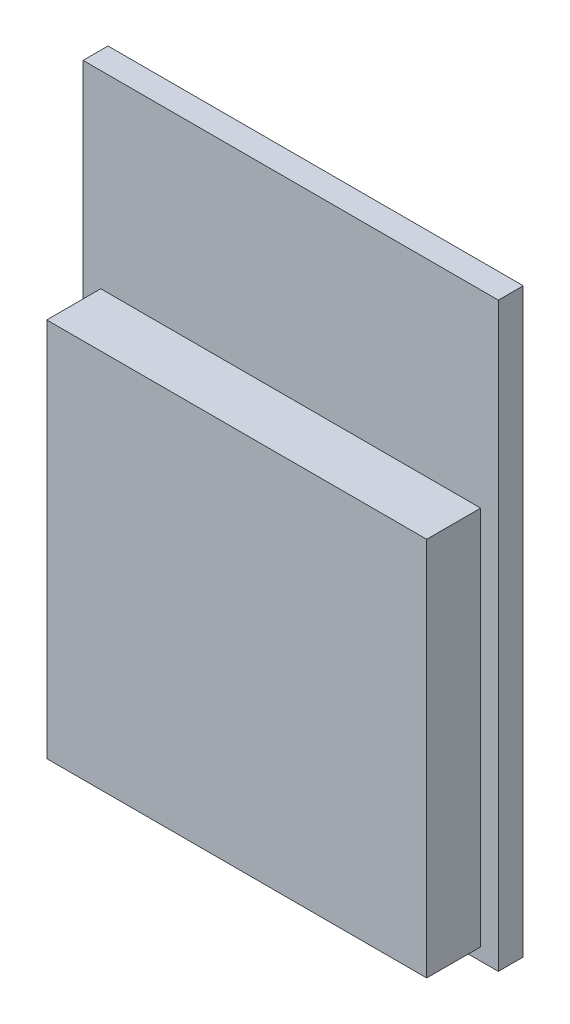
ISO-10303-21;
HEADER;
FILE_DESCRIPTION(('STEP AP214'),'2;1');
FILE_NAME('part.step','',(''),(''),'','','');
FILE_SCHEMA(('AUTOMOTIVE_DESIGN { 1 0 10303 214 1 1 1 1 }'));
ENDSEC;
DATA;
#1=APPLICATION_CONTEXT('core data for automotive mechanical design processes');
#2=APPLICATION_PROTOCOL_DEFINITION('international standard','automotive_design',2000,#1);
#3=PRODUCT_CONTEXT('',#1,'mechanical');
#4=PRODUCT('Part','Part','',(#3));
#5=PRODUCT_RELATED_PRODUCT_CATEGORY('part','',(#4));
#6=PRODUCT_DEFINITION_FORMATION('','',#4);
#7=PRODUCT_DEFINITION_CONTEXT('part definition',#1,'design');
#8=PRODUCT_DEFINITION('design','',#6,#7);
#9=PRODUCT_DEFINITION_SHAPE('','',#8);
#10=(LENGTH_UNIT() NAMED_UNIT(*) SI_UNIT(.MILLI.,.METRE.));
#11=(NAMED_UNIT(*) PLANE_ANGLE_UNIT() SI_UNIT($,.RADIAN.));
#12=(NAMED_UNIT(*) SI_UNIT($,.STERADIAN.) SOLID_ANGLE_UNIT());
#13=UNCERTAINTY_MEASURE_WITH_UNIT(LENGTH_MEASURE(1.E-05),#10,'distance_accuracy_value','');
#14=(GEOMETRIC_REPRESENTATION_CONTEXT(3) GLOBAL_UNCERTAINTY_ASSIGNED_CONTEXT((#13)) GLOBAL_UNIT_ASSIGNED_CONTEXT((#10,
#11,#12)) REPRESENTATION_CONTEXT('',''));
#15=CARTESIAN_POINT('',(0.,0.,0.));
#16=DIRECTION('',(0.,0.,1.));
#17=DIRECTION('',(1.,0.,0.));
#18=AXIS2_PLACEMENT_3D('',#15,#16,#17);
#19=CARTESIAN_POINT('',(0.,0.,0.6));
#20=DIRECTION('',(0.,0.,-1.));
#21=DIRECTION('',(-1.,0.,0.));
#22=AXIS2_PLACEMENT_3D('',#19,#20,#21);
#23=PLANE('',#22);
#24=DIRECTION('',(0.,1.,0.));
#25=VECTOR('',#24,1.);
#26=CARTESIAN_POINT('',(5.,-7.,0.6));
#27=LINE('',#26,#25);
#28=CARTESIAN_POINT('',(5.,-7.,0.6));
#29=VERTEX_POINT('',#28);
#30=CARTESIAN_POINT('',(5.,7.,0.6));
#31=VERTEX_POINT('',#30);
#32=EDGE_CURVE('E128',#29,#31,#27,.T.);
#33=ORIENTED_EDGE('',*,*,#32,.T.);
#34=DIRECTION('',(-1.,0.,0.));
#35=VECTOR('',#34,1.);
#36=CARTESIAN_POINT('',(-5.,7.,0.6));
#37=LINE('',#36,#35);
#38=CARTESIAN_POINT('',(-5.,7.,0.6));
#39=VERTEX_POINT('',#38);
#40=EDGE_CURVE('E131',#31,#39,#37,.T.);
#41=ORIENTED_EDGE('',*,*,#40,.T.);
#42=DIRECTION('',(0.,-1.,0.));
#43=VECTOR('',#42,1.);
#44=CARTESIAN_POINT('',(-5.,-7.,0.6));
#45=LINE('',#44,#43);
#46=CARTESIAN_POINT('',(-5.,-7.,0.6));
#47=VERTEX_POINT('',#46);
#48=EDGE_CURVE('E134',#39,#47,#45,.T.);
#49=ORIENTED_EDGE('',*,*,#48,.T.);
#50=DIRECTION('',(1.,0.,0.));
#51=VECTOR('',#50,1.);
#52=CARTESIAN_POINT('',(-5.,-7.,0.6));
#53=LINE('',#52,#51);
#54=EDGE_CURVE('E136',#47,#29,#53,.T.);
#55=ORIENTED_EDGE('',*,*,#54,.T.);
#56=EDGE_LOOP('',(#33,#41,#49,#55));
#57=FACE_BOUND('',#56,.T.);
#58=DIRECTION('',(0.,-1.,0.));
#59=VECTOR('',#58,1.);
#60=CARTESIAN_POINT('',(-4.575,2.45,0.6));
#61=LINE('',#60,#59);
#62=CARTESIAN_POINT('',(-4.575,2.45,0.6));
#63=VERTEX_POINT('',#62);
#64=CARTESIAN_POINT('',(-4.575,-6.7,0.6));
#65=VERTEX_POINT('',#64);
#66=EDGE_CURVE('E118',#63,#65,#61,.T.);
#67=ORIENTED_EDGE('',*,*,#66,.F.);
#68=DIRECTION('',(-1.,0.,0.));
#69=VECTOR('',#68,1.);
#70=CARTESIAN_POINT('',(-4.575,2.45,0.6));
#71=LINE('',#70,#69);
#72=CARTESIAN_POINT('',(4.575,2.45,0.6));
#73=VERTEX_POINT('',#72);
#74=EDGE_CURVE('E115',#73,#63,#71,.T.);
#75=ORIENTED_EDGE('',*,*,#74,.F.);
#76=DIRECTION('',(0.,1.,0.));
#77=VECTOR('',#76,1.);
#78=CARTESIAN_POINT('',(4.575,2.45,0.6));
#79=LINE('',#78,#77);
#80=CARTESIAN_POINT('',(4.57500000000001,-6.7,0.6));
#81=VERTEX_POINT('',#80);
#82=EDGE_CURVE('E53',#81,#73,#79,.T.);
#83=ORIENTED_EDGE('',*,*,#82,.F.);
#84=DIRECTION('',(1.,0.,0.));
#85=VECTOR('',#84,1.);
#86=CARTESIAN_POINT('',(-4.575,-6.7,0.6));
#87=LINE('',#86,#85);
#88=EDGE_CURVE('E48',#65,#81,#87,.T.);
#89=ORIENTED_EDGE('',*,*,#88,.F.);
#90=EDGE_LOOP('',(#67,#75,#83,#89));
#91=FACE_BOUND('',#90,.T.);
#92=ADVANCED_FACE('F33',(#57,#91),#23,.F.);
#93=CARTESIAN_POINT('',(5.,-7.,0.6));
#94=DIRECTION('',(-1.,0.,0.));
#95=DIRECTION('',(0.,0.,1.));
#96=AXIS2_PLACEMENT_3D('',#93,#94,#95);
#97=PLANE('',#96);
#98=DIRECTION('',(0.,1.,0.));
#99=VECTOR('',#98,1.);
#100=CARTESIAN_POINT('',(5.,-7.,0.));
#101=LINE('',#100,#99);
#102=CARTESIAN_POINT('',(5.,-7.,0.));
#103=VERTEX_POINT('',#102);
#104=CARTESIAN_POINT('',(5.,7.,0.));
#105=VERTEX_POINT('',#104);
#106=EDGE_CURVE('E119',#103,#105,#101,.T.);
#107=ORIENTED_EDGE('',*,*,#106,.T.);
#108=DIRECTION('',(0.,0.,-1.));
#109=VECTOR('',#108,1.);
#110=CARTESIAN_POINT('',(5.,7.,0.6));
#111=LINE('',#110,#109);
#112=EDGE_CURVE('E11',#31,#105,#111,.T.);
#113=ORIENTED_EDGE('',*,*,#112,.F.);
#114=ORIENTED_EDGE('',*,*,#32,.F.);
#115=DIRECTION('',(0.,0.,-1.));
#116=VECTOR('',#115,1.);
#117=CARTESIAN_POINT('',(5.,-7.,0.6));
#118=LINE('',#117,#116);
#119=EDGE_CURVE('E137',#29,#103,#118,.T.);
#120=ORIENTED_EDGE('',*,*,#119,.T.);
#121=EDGE_LOOP('',(#107,#113,#114,#120));
#122=FACE_BOUND('',#121,.T.);
#123=ADVANCED_FACE('F35',(#122),#97,.F.);
#124=CARTESIAN_POINT('',(-5.,7.,0.6));
#125=DIRECTION('',(0.,-1.,0.));
#126=DIRECTION('',(0.,0.,-1.));
#127=AXIS2_PLACEMENT_3D('',#124,#125,#126);
#128=PLANE('',#127);
#129=DIRECTION('',(-1.,0.,0.));
#130=VECTOR('',#129,1.);
#131=CARTESIAN_POINT('',(-5.,7.,0.));
#132=LINE('',#131,#130);
#133=CARTESIAN_POINT('',(-5.,7.,0.));
#134=VERTEX_POINT('',#133);
#135=EDGE_CURVE('E122',#105,#134,#132,.T.);
#136=ORIENTED_EDGE('',*,*,#135,.T.);
#137=DIRECTION('',(0.,0.,-1.));
#138=VECTOR('',#137,1.);
#139=CARTESIAN_POINT('',(-5.,7.,0.6));
#140=LINE('',#139,#138);
#141=EDGE_CURVE('E41',#39,#134,#140,.T.);
#142=ORIENTED_EDGE('',*,*,#141,.F.);
#143=ORIENTED_EDGE('',*,*,#40,.F.);
#144=ORIENTED_EDGE('',*,*,#112,.T.);
#145=EDGE_LOOP('',(#136,#142,#143,#144));
#146=FACE_BOUND('',#145,.T.);
#147=ADVANCED_FACE('F167',(#146),#128,.F.);
#148=CARTESIAN_POINT('',(-5.,-7.,0.6));
#149=DIRECTION('',(1.,0.,0.));
#150=DIRECTION('',(0.,0.,-1.));
#151=AXIS2_PLACEMENT_3D('',#148,#149,#150);
#152=PLANE('',#151);
#153=DIRECTION('',(0.,-1.,0.));
#154=VECTOR('',#153,1.);
#155=CARTESIAN_POINT('',(-5.,-7.,0.));
#156=LINE('',#155,#154);
#157=CARTESIAN_POINT('',(-5.,-7.,0.));
#158=VERTEX_POINT('',#157);
#159=EDGE_CURVE('E140',#134,#158,#156,.T.);
#160=ORIENTED_EDGE('',*,*,#159,.T.);
#161=DIRECTION('',(0.,0.,-1.));
#162=VECTOR('',#161,1.);
#163=CARTESIAN_POINT('',(-5.,-7.,0.6));
#164=LINE('',#163,#162);
#165=EDGE_CURVE('E145',#47,#158,#164,.T.);
#166=ORIENTED_EDGE('',*,*,#165,.F.);
#167=ORIENTED_EDGE('',*,*,#48,.F.);
#168=ORIENTED_EDGE('',*,*,#141,.T.);
#169=EDGE_LOOP('',(#160,#166,#167,#168));
#170=FACE_BOUND('',#169,.T.);
#171=ADVANCED_FACE('F152',(#170),#152,.F.);
#172=CARTESIAN_POINT('',(-5.,-7.,0.6));
#173=DIRECTION('',(0.,1.,0.));
#174=DIRECTION('',(0.,0.,1.));
#175=AXIS2_PLACEMENT_3D('',#172,#173,#174);
#176=PLANE('',#175);
#177=DIRECTION('',(1.,0.,0.));
#178=VECTOR('',#177,1.);
#179=CARTESIAN_POINT('',(-5.,-7.,0.));
#180=LINE('',#179,#178);
#181=EDGE_CURVE('E132',#158,#103,#180,.T.);
#182=ORIENTED_EDGE('',*,*,#181,.T.);
#183=ORIENTED_EDGE('',*,*,#119,.F.);
#184=ORIENTED_EDGE('',*,*,#54,.F.);
#185=ORIENTED_EDGE('',*,*,#165,.T.);
#186=EDGE_LOOP('',(#182,#183,#184,#185));
#187=FACE_BOUND('',#186,.T.);
#188=ADVANCED_FACE('F161',(#187),#176,.F.);
#189=CARTESIAN_POINT('',(0.,0.,0.));
#190=DIRECTION('',(0.,0.,-1.));
#191=DIRECTION('',(-1.,0.,0.));
#192=AXIS2_PLACEMENT_3D('',#189,#190,#191);
#193=PLANE('',#192);
#194=ORIENTED_EDGE('',*,*,#106,.F.);
#195=ORIENTED_EDGE('',*,*,#181,.F.);
#196=ORIENTED_EDGE('',*,*,#159,.F.);
#197=ORIENTED_EDGE('',*,*,#135,.F.);
#198=EDGE_LOOP('',(#194,#195,#196,#197));
#199=FACE_BOUND('',#198,.T.);
#200=ADVANCED_FACE('F158',(#199),#193,.T.);
#201=CARTESIAN_POINT('',(-4.575,2.45,1.9));
#202=DIRECTION('',(1.,0.,0.));
#203=DIRECTION('',(0.,1.,0.));
#204=AXIS2_PLACEMENT_3D('',#201,#202,#203);
#205=PLANE('',#204);
#206=ORIENTED_EDGE('',*,*,#66,.T.);
#207=DIRECTION('',(0.,0.,-1.));
#208=VECTOR('',#207,1.);
#209=CARTESIAN_POINT('',(-4.575,-6.7,1.9));
#210=LINE('',#209,#208);
#211=CARTESIAN_POINT('',(-4.575,-6.7,1.9));
#212=VERTEX_POINT('',#211);
#213=EDGE_CURVE('E99',#212,#65,#210,.T.);
#214=ORIENTED_EDGE('',*,*,#213,.F.);
#215=DIRECTION('',(0.,-1.,0.));
#216=VECTOR('',#215,1.);
#217=CARTESIAN_POINT('',(-4.575,2.45,1.9));
#218=LINE('',#217,#216);
#219=CARTESIAN_POINT('',(-4.575,2.45,1.9));
#220=VERTEX_POINT('',#219);
#221=EDGE_CURVE('E106',#220,#212,#218,.T.);
#222=ORIENTED_EDGE('',*,*,#221,.F.);
#223=DIRECTION('',(0.,0.,-1.));
#224=VECTOR('',#223,1.);
#225=CARTESIAN_POINT('',(-4.575,2.45,1.9));
#226=LINE('',#225,#224);
#227=EDGE_CURVE('E260',#220,#63,#226,.T.);
#228=ORIENTED_EDGE('',*,*,#227,.T.);
#229=EDGE_LOOP('',(#206,#214,#222,#228));
#230=FACE_BOUND('',#229,.T.);
#231=ADVANCED_FACE('F117',(#230),#205,.F.);
#232=CARTESIAN_POINT('',(-4.575,-6.7,1.9));
#233=DIRECTION('',(0.,1.,0.));
#234=DIRECTION('',(-1.,0.,0.));
#235=AXIS2_PLACEMENT_3D('',#232,#233,#234);
#236=PLANE('',#235);
#237=ORIENTED_EDGE('',*,*,#88,.T.);
#238=DIRECTION('',(0.,0.,-1.));
#239=VECTOR('',#238,1.);
#240=CARTESIAN_POINT('',(4.57500000000001,-6.7,1.9));
#241=LINE('',#240,#239);
#242=CARTESIAN_POINT('',(4.57500000000001,-6.7,1.9));
#243=VERTEX_POINT('',#242);
#244=EDGE_CURVE('E102',#243,#81,#241,.T.);
#245=ORIENTED_EDGE('',*,*,#244,.F.);
#246=DIRECTION('',(1.,0.,0.));
#247=VECTOR('',#246,1.);
#248=CARTESIAN_POINT('',(-4.575,-6.7,1.9));
#249=LINE('',#248,#247);
#250=EDGE_CURVE('E95',#212,#243,#249,.T.);
#251=ORIENTED_EDGE('',*,*,#250,.F.);
#252=ORIENTED_EDGE('',*,*,#213,.T.);
#253=EDGE_LOOP('',(#237,#245,#251,#252));
#254=FACE_BOUND('',#253,.T.);
#255=ADVANCED_FACE('F97',(#254),#236,.F.);
#256=CARTESIAN_POINT('',(4.575,2.45,1.9));
#257=DIRECTION('',(-1.,0.,0.));
#258=DIRECTION('',(0.,-1.,0.));
#259=AXIS2_PLACEMENT_3D('',#256,#257,#258);
#260=PLANE('',#259);
#261=ORIENTED_EDGE('',*,*,#82,.T.);
#262=DIRECTION('',(0.,0.,-1.));
#263=VECTOR('',#262,1.);
#264=CARTESIAN_POINT('',(4.575,2.45,1.9));
#265=LINE('',#264,#263);
#266=CARTESIAN_POINT('',(4.575,2.45,1.9));
#267=VERTEX_POINT('',#266);
#268=EDGE_CURVE('E124',#267,#73,#265,.T.);
#269=ORIENTED_EDGE('',*,*,#268,.F.);
#270=DIRECTION('',(0.,1.,0.));
#271=VECTOR('',#270,1.);
#272=CARTESIAN_POINT('',(4.575,2.45,1.9));
#273=LINE('',#272,#271);
#274=EDGE_CURVE('E105',#243,#267,#273,.T.);
#275=ORIENTED_EDGE('',*,*,#274,.F.);
#276=ORIENTED_EDGE('',*,*,#244,.T.);
#277=EDGE_LOOP('',(#261,#269,#275,#276));
#278=FACE_BOUND('',#277,.T.);
#279=ADVANCED_FACE('F203',(#278),#260,.F.);
#280=CARTESIAN_POINT('',(-4.575,2.45,1.9));
#281=DIRECTION('',(0.,-1.,0.));
#282=DIRECTION('',(1.,0.,0.));
#283=AXIS2_PLACEMENT_3D('',#280,#281,#282);
#284=PLANE('',#283);
#285=ORIENTED_EDGE('',*,*,#74,.T.);
#286=ORIENTED_EDGE('',*,*,#227,.F.);
#287=DIRECTION('',(-1.,0.,0.));
#288=VECTOR('',#287,1.);
#289=CARTESIAN_POINT('',(-4.575,2.45,1.9));
#290=LINE('',#289,#288);
#291=EDGE_CURVE('E111',#267,#220,#290,.T.);
#292=ORIENTED_EDGE('',*,*,#291,.F.);
#293=ORIENTED_EDGE('',*,*,#268,.T.);
#294=EDGE_LOOP('',(#285,#286,#292,#293));
#295=FACE_BOUND('',#294,.T.);
#296=ADVANCED_FACE('F209',(#295),#284,.F.);
#297=CARTESIAN_POINT('',(0.,0.,1.9));
#298=DIRECTION('',(0.,0.,1.));
#299=DIRECTION('',(1.,0.,0.));
#300=AXIS2_PLACEMENT_3D('',#297,#298,#299);
#301=PLANE('',#300);
#302=ORIENTED_EDGE('',*,*,#221,.T.);
#303=ORIENTED_EDGE('',*,*,#250,.T.);
#304=ORIENTED_EDGE('',*,*,#274,.T.);
#305=ORIENTED_EDGE('',*,*,#291,.T.);
#306=EDGE_LOOP('',(#302,#303,#304,#305));
#307=FACE_BOUND('',#306,.T.);
#308=ADVANCED_FACE('F109',(#307),#301,.T.);
#309=CLOSED_SHELL('',(#92,#123,#147,#171,#188,#200,#231,#255,#279,#296,#308));
#310=MANIFOLD_SOLID_BREP('B2',#309);
#311=ADVANCED_BREP_SHAPE_REPRESENTATION('',(#18,#310),#14);
#312=SHAPE_DEFINITION_REPRESENTATION(#9,#311);
ENDSEC;
END-ISO-10303-21;
